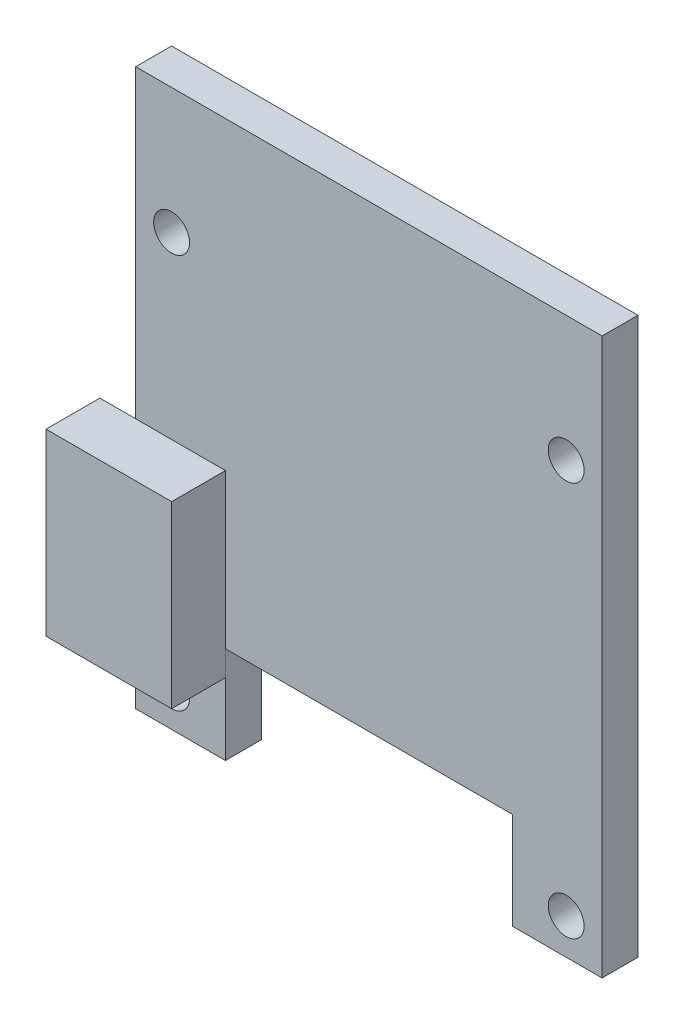
ISO-10303-21;
HEADER;
FILE_DESCRIPTION(('STEP AP214'),'2;1');
FILE_NAME('part.step','',(''),(''),'','','');
FILE_SCHEMA(('AUTOMOTIVE_DESIGN { 1 0 10303 214 1 1 1 1 }'));
ENDSEC;
DATA;
#1=APPLICATION_CONTEXT('core data for automotive mechanical design processes');
#2=APPLICATION_PROTOCOL_DEFINITION('international standard','automotive_design',2000,#1);
#3=PRODUCT_CONTEXT('',#1,'mechanical');
#4=PRODUCT('Part','Part','',(#3));
#5=PRODUCT_RELATED_PRODUCT_CATEGORY('part','',(#4));
#6=PRODUCT_DEFINITION_FORMATION('','',#4);
#7=PRODUCT_DEFINITION_CONTEXT('part definition',#1,'design');
#8=PRODUCT_DEFINITION('design','',#6,#7);
#9=PRODUCT_DEFINITION_SHAPE('','',#8);
#10=(LENGTH_UNIT() NAMED_UNIT(*) SI_UNIT(.MILLI.,.METRE.));
#11=(NAMED_UNIT(*) PLANE_ANGLE_UNIT() SI_UNIT($,.RADIAN.));
#12=(NAMED_UNIT(*) SI_UNIT($,.STERADIAN.) SOLID_ANGLE_UNIT());
#13=UNCERTAINTY_MEASURE_WITH_UNIT(LENGTH_MEASURE(1.E-05),#10,'distance_accuracy_value','');
#14=(GEOMETRIC_REPRESENTATION_CONTEXT(3) GLOBAL_UNCERTAINTY_ASSIGNED_CONTEXT((#13)) GLOBAL_UNIT_ASSIGNED_CONTEXT((#10,
#11,#12)) REPRESENTATION_CONTEXT('',''));
#15=CARTESIAN_POINT('',(0.,0.,0.));
#16=DIRECTION('',(0.,0.,1.));
#17=DIRECTION('',(1.,0.,0.));
#18=AXIS2_PLACEMENT_3D('',#15,#16,#17);
#19=CARTESIAN_POINT('',(0.,-11.5,5.));
#20=DIRECTION('',(0.,1.,0.));
#21=DIRECTION('',(0.,0.,1.));
#22=AXIS2_PLACEMENT_3D('',#19,#20,#21);
#23=PLANE('',#22);
#24=DIRECTION('',(1.,0.,0.));
#25=VECTOR('',#24,1.);
#26=CARTESIAN_POINT('',(0.,-11.5,2.));
#27=LINE('',#26,#25);
#28=CARTESIAN_POINT('',(-15.,-11.5,2.));
#29=VERTEX_POINT('',#28);
#30=CARTESIAN_POINT('',(-8.,-11.5,2.));
#31=VERTEX_POINT('',#30);
#32=EDGE_CURVE('E110',#29,#31,#27,.T.);
#33=ORIENTED_EDGE('',*,*,#32,.T.);
#34=DIRECTION('',(0.,0.,-1.));
#35=VECTOR('',#34,1.);
#36=CARTESIAN_POINT('',(-8.,-11.5,5.));
#37=LINE('',#36,#35);
#38=CARTESIAN_POINT('',(-8.,-11.5,5.));
#39=VERTEX_POINT('',#38);
#40=EDGE_CURVE('E12',#39,#31,#37,.T.);
#41=ORIENTED_EDGE('',*,*,#40,.F.);
#42=DIRECTION('',(1.,0.,0.));
#43=VECTOR('',#42,1.);
#44=CARTESIAN_POINT('',(0.,-11.5,5.));
#45=LINE('',#44,#43);
#46=CARTESIAN_POINT('',(-15.,-11.5,5.));
#47=VERTEX_POINT('',#46);
#48=EDGE_CURVE('E87',#47,#39,#45,.T.);
#49=ORIENTED_EDGE('',*,*,#48,.F.);
#50=DIRECTION('',(0.,0.,-1.));
#51=VECTOR('',#50,1.);
#52=CARTESIAN_POINT('',(-15.,-11.5,5.));
#53=LINE('',#52,#51);
#54=EDGE_CURVE('E63',#47,#29,#53,.T.);
#55=ORIENTED_EDGE('',*,*,#54,.T.);
#56=EDGE_LOOP('',(#33,#41,#49,#55));
#57=FACE_BOUND('',#56,.T.);
#58=ADVANCED_FACE('F47',(#57),#23,.F.);
#59=CARTESIAN_POINT('',(-8.,0.,5.));
#60=DIRECTION('',(1.,0.,0.));
#61=DIRECTION('',(0.,0.,-1.));
#62=AXIS2_PLACEMENT_3D('',#59,#60,#61);
#63=PLANE('',#62);
#64=DIRECTION('',(0.,-1.,0.));
#65=VECTOR('',#64,1.);
#66=CARTESIAN_POINT('',(-8.,0.,2.));
#67=LINE('',#66,#65);
#68=CARTESIAN_POINT('',(-8.,-1.5,2.));
#69=VERTEX_POINT('',#68);
#70=EDGE_CURVE('E96',#69,#31,#67,.T.);
#71=ORIENTED_EDGE('',*,*,#70,.F.);
#72=DIRECTION('',(0.,0.,-1.));
#73=VECTOR('',#72,1.);
#74=CARTESIAN_POINT('',(-8.,-1.5,5.));
#75=LINE('',#74,#73);
#76=CARTESIAN_POINT('',(-8.,-1.5,5.));
#77=VERTEX_POINT('',#76);
#78=EDGE_CURVE('E55',#77,#69,#75,.T.);
#79=ORIENTED_EDGE('',*,*,#78,.F.);
#80=DIRECTION('',(0.,-1.,0.));
#81=VECTOR('',#80,1.);
#82=CARTESIAN_POINT('',(-8.,0.,5.));
#83=LINE('',#82,#81);
#84=EDGE_CURVE('E94',#77,#39,#83,.T.);
#85=ORIENTED_EDGE('',*,*,#84,.T.);
#86=ORIENTED_EDGE('',*,*,#40,.T.);
#87=EDGE_LOOP('',(#71,#79,#85,#86));
#88=FACE_BOUND('',#87,.T.);
#89=ADVANCED_FACE('F93',(#88),#63,.T.);
#90=CARTESIAN_POINT('',(0.,-1.5,5.));
#91=DIRECTION('',(0.,1.,0.));
#92=DIRECTION('',(-1.,0.,0.));
#93=AXIS2_PLACEMENT_3D('',#90,#91,#92);
#94=PLANE('',#93);
#95=DIRECTION('',(1.,0.,0.));
#96=VECTOR('',#95,1.);
#97=CARTESIAN_POINT('',(0.,-1.5,2.));
#98=LINE('',#97,#96);
#99=CARTESIAN_POINT('',(-15.,-1.5,2.));
#100=VERTEX_POINT('',#99);
#101=EDGE_CURVE('E113',#100,#69,#98,.T.);
#102=ORIENTED_EDGE('',*,*,#101,.F.);
#103=DIRECTION('',(0.,0.,-1.));
#104=VECTOR('',#103,1.);
#105=CARTESIAN_POINT('',(-15.,-1.5,5.));
#106=LINE('',#105,#104);
#107=CARTESIAN_POINT('',(-15.,-1.5,5.));
#108=VERTEX_POINT('',#107);
#109=EDGE_CURVE('E76',#108,#100,#106,.T.);
#110=ORIENTED_EDGE('',*,*,#109,.F.);
#111=DIRECTION('',(1.,0.,0.));
#112=VECTOR('',#111,1.);
#113=CARTESIAN_POINT('',(0.,-1.5,5.));
#114=LINE('',#113,#112);
#115=EDGE_CURVE('E102',#108,#77,#114,.T.);
#116=ORIENTED_EDGE('',*,*,#115,.T.);
#117=ORIENTED_EDGE('',*,*,#78,.T.);
#118=EDGE_LOOP('',(#102,#110,#116,#117));
#119=FACE_BOUND('',#118,.T.);
#120=ADVANCED_FACE('F104',(#119),#94,.T.);
#121=CARTESIAN_POINT('',(-15.,0.,5.));
#122=DIRECTION('',(-1.,0.,0.));
#123=DIRECTION('',(0.,-1.,0.));
#124=AXIS2_PLACEMENT_3D('',#121,#122,#123);
#125=PLANE('',#124);
#126=DIRECTION('',(0.,1.,0.));
#127=VECTOR('',#126,1.);
#128=CARTESIAN_POINT('',(-15.,0.,2.));
#129=LINE('',#128,#127);
#130=EDGE_CURVE('E115',#29,#100,#129,.T.);
#131=ORIENTED_EDGE('',*,*,#130,.F.);
#132=ORIENTED_EDGE('',*,*,#54,.F.);
#133=DIRECTION('',(0.,1.,0.));
#134=VECTOR('',#133,1.);
#135=CARTESIAN_POINT('',(-15.,0.,5.));
#136=LINE('',#135,#134);
#137=EDGE_CURVE('E105',#47,#108,#136,.T.);
#138=ORIENTED_EDGE('',*,*,#137,.T.);
#139=ORIENTED_EDGE('',*,*,#109,.T.);
#140=EDGE_LOOP('',(#131,#132,#138,#139));
#141=FACE_BOUND('',#140,.T.);
#142=ADVANCED_FACE('F121',(#141),#125,.T.);
#143=CARTESIAN_POINT('',(0.,0.,5.));
#144=DIRECTION('',(0.,0.,-1.));
#145=DIRECTION('',(-1.,0.,0.));
#146=AXIS2_PLACEMENT_3D('',#143,#144,#145);
#147=PLANE('',#146);
#148=ORIENTED_EDGE('',*,*,#48,.T.);
#149=ORIENTED_EDGE('',*,*,#84,.F.);
#150=ORIENTED_EDGE('',*,*,#115,.F.);
#151=ORIENTED_EDGE('',*,*,#137,.F.);
#152=EDGE_LOOP('',(#148,#149,#150,#151));
#153=FACE_BOUND('',#152,.T.);
#154=ADVANCED_FACE('F101',(#153),#147,.F.);
#155=CARTESIAN_POINT('',(0.,0.,2.));
#156=DIRECTION('',(0.,0.,-1.));
#157=DIRECTION('',(-1.,0.,0.));
#158=AXIS2_PLACEMENT_3D('',#155,#156,#157);
#159=PLANE('',#158);
#160=ORIENTED_EDGE('',*,*,#32,.F.);
#161=ORIENTED_EDGE('',*,*,#130,.T.);
#162=ORIENTED_EDGE('',*,*,#101,.T.);
#163=ORIENTED_EDGE('',*,*,#70,.T.);
#164=EDGE_LOOP('',(#160,#161,#162,#163));
#165=FACE_BOUND('',#164,.T.);
#166=ADVANCED_FACE('F120',(#165),#159,.T.);
#167=CLOSED_SHELL('',(#58,#89,#120,#142,#154,#166));
#168=MANIFOLD_SOLID_BREP('B2',#167);
#169=CARTESIAN_POINT('',(-13.,0.,2.));
#170=DIRECTION('',(-1.,0.,0.));
#171=DIRECTION('',(0.,0.,1.));
#172=AXIS2_PLACEMENT_3D('',#169,#170,#171);
#173=PLANE('',#172);
#174=DIRECTION('',(0.,1.,0.));
#175=VECTOR('',#174,1.);
#176=CARTESIAN_POINT('',(-13.,0.,0.));
#177=LINE('',#176,#175);
#178=CARTESIAN_POINT('',(-13.,-15.5,0.));
#179=VERTEX_POINT('',#178);
#180=CARTESIAN_POINT('',(-13.,15.5,0.));
#181=VERTEX_POINT('',#180);
#182=EDGE_CURVE('E271',#179,#181,#177,.T.);
#183=ORIENTED_EDGE('',*,*,#182,.F.);
#184=DIRECTION('',(0.,0.,-1.));
#185=VECTOR('',#184,1.);
#186=CARTESIAN_POINT('',(-13.,-15.5,2.));
#187=LINE('',#186,#185);
#188=CARTESIAN_POINT('',(-13.,-15.5,2.));
#189=VERTEX_POINT('',#188);
#190=EDGE_CURVE('E45',#189,#179,#187,.T.);
#191=ORIENTED_EDGE('',*,*,#190,.F.);
#192=DIRECTION('',(0.,1.,0.));
#193=VECTOR('',#192,1.);
#194=CARTESIAN_POINT('',(-13.,0.,2.));
#195=LINE('',#194,#193);
#196=CARTESIAN_POINT('',(-13.,15.5,2.));
#197=VERTEX_POINT('',#196);
#198=EDGE_CURVE('E288',#189,#197,#195,.T.);
#199=ORIENTED_EDGE('',*,*,#198,.T.);
#200=DIRECTION('',(0.,0.,-1.));
#201=VECTOR('',#200,1.);
#202=CARTESIAN_POINT('',(-13.,15.5,2.));
#203=LINE('',#202,#201);
#204=EDGE_CURVE('E193',#197,#181,#203,.T.);
#205=ORIENTED_EDGE('',*,*,#204,.T.);
#206=EDGE_LOOP('',(#183,#191,#199,#205));
#207=FACE_BOUND('',#206,.T.);
#208=ADVANCED_FACE('F177',(#207),#173,.T.);
#209=CARTESIAN_POINT('',(0.,-15.5,2.));
#210=DIRECTION('',(0.,1.,0.));
#211=DIRECTION('',(0.,0.,1.));
#212=AXIS2_PLACEMENT_3D('',#209,#210,#211);
#213=PLANE('',#212);
#214=DIRECTION('',(1.,0.,0.));
#215=VECTOR('',#214,1.);
#216=CARTESIAN_POINT('',(0.,-15.5,0.));
#217=LINE('',#216,#215);
#218=CARTESIAN_POINT('',(-8.,-15.5,0.));
#219=VERTEX_POINT('',#218);
#220=EDGE_CURVE('E273',#179,#219,#217,.T.);
#221=ORIENTED_EDGE('',*,*,#220,.T.);
#222=DIRECTION('',(0.,0.,-1.));
#223=VECTOR('',#222,1.);
#224=CARTESIAN_POINT('',(-8.,-15.5,2.));
#225=LINE('',#224,#223);
#226=CARTESIAN_POINT('',(-8.,-15.5,2.));
#227=VERTEX_POINT('',#226);
#228=EDGE_CURVE('E185',#227,#219,#225,.T.);
#229=ORIENTED_EDGE('',*,*,#228,.F.);
#230=DIRECTION('',(1.,0.,0.));
#231=VECTOR('',#230,1.);
#232=CARTESIAN_POINT('',(0.,-15.5,2.));
#233=LINE('',#232,#231);
#234=EDGE_CURVE('E321',#189,#227,#233,.T.);
#235=ORIENTED_EDGE('',*,*,#234,.F.);
#236=ORIENTED_EDGE('',*,*,#190,.T.);
#237=EDGE_LOOP('',(#221,#229,#235,#236));
#238=FACE_BOUND('',#237,.T.);
#239=ADVANCED_FACE('F376',(#238),#213,.F.);
#240=CARTESIAN_POINT('',(-8.,0.,2.));
#241=DIRECTION('',(-1.,0.,0.));
#242=DIRECTION('',(0.,0.,1.));
#243=AXIS2_PLACEMENT_3D('',#240,#241,#242);
#244=PLANE('',#243);
#245=DIRECTION('',(0.,1.,0.));
#246=VECTOR('',#245,1.);
#247=CARTESIAN_POINT('',(-8.,0.,0.));
#248=LINE('',#247,#246);
#249=CARTESIAN_POINT('',(-8.,-10.1,0.));
#250=VERTEX_POINT('',#249);
#251=EDGE_CURVE('E276',#219,#250,#248,.T.);
#252=ORIENTED_EDGE('',*,*,#251,.T.);
#253=DIRECTION('',(0.,0.,-1.));
#254=VECTOR('',#253,1.);
#255=CARTESIAN_POINT('',(-8.,-10.1,2.));
#256=LINE('',#255,#254);
#257=CARTESIAN_POINT('',(-8.,-10.1,2.));
#258=VERTEX_POINT('',#257);
#259=EDGE_CURVE('E295',#258,#250,#256,.T.);
#260=ORIENTED_EDGE('',*,*,#259,.F.);
#261=DIRECTION('',(0.,1.,0.));
#262=VECTOR('',#261,1.);
#263=CARTESIAN_POINT('',(-8.,0.,2.));
#264=LINE('',#263,#262);
#265=EDGE_CURVE('E304',#227,#258,#264,.T.);
#266=ORIENTED_EDGE('',*,*,#265,.F.);
#267=ORIENTED_EDGE('',*,*,#228,.T.);
#268=EDGE_LOOP('',(#252,#260,#266,#267));
#269=FACE_BOUND('',#268,.T.);
#270=ADVANCED_FACE('F302',(#269),#244,.F.);
#271=CARTESIAN_POINT('',(0.,-10.1,2.));
#272=DIRECTION('',(0.,1.,0.));
#273=DIRECTION('',(0.,0.,1.));
#274=AXIS2_PLACEMENT_3D('',#271,#272,#273);
#275=PLANE('',#274);
#276=DIRECTION('',(1.,0.,0.));
#277=VECTOR('',#276,1.);
#278=CARTESIAN_POINT('',(0.,-10.1,0.));
#279=LINE('',#278,#277);
#280=CARTESIAN_POINT('',(8.,-10.1,0.));
#281=VERTEX_POINT('',#280);
#282=EDGE_CURVE('E278',#250,#281,#279,.T.);
#283=ORIENTED_EDGE('',*,*,#282,.T.);
#284=DIRECTION('',(0.,0.,-1.));
#285=VECTOR('',#284,1.);
#286=CARTESIAN_POINT('',(8.,-10.1,2.));
#287=LINE('',#286,#285);
#288=CARTESIAN_POINT('',(8.,-10.1,2.));
#289=VERTEX_POINT('',#288);
#290=EDGE_CURVE('E292',#289,#281,#287,.T.);
#291=ORIENTED_EDGE('',*,*,#290,.F.);
#292=DIRECTION('',(1.,0.,0.));
#293=VECTOR('',#292,1.);
#294=CARTESIAN_POINT('',(0.,-10.1,2.));
#295=LINE('',#294,#293);
#296=EDGE_CURVE('E317',#258,#289,#295,.T.);
#297=ORIENTED_EDGE('',*,*,#296,.F.);
#298=ORIENTED_EDGE('',*,*,#259,.T.);
#299=EDGE_LOOP('',(#283,#291,#297,#298));
#300=FACE_BOUND('',#299,.T.);
#301=ADVANCED_FACE('F313',(#300),#275,.F.);
#302=CARTESIAN_POINT('',(8.00000000000001,0.,2.));
#303=DIRECTION('',(1.,0.,0.));
#304=DIRECTION('',(0.,1.,0.));
#305=AXIS2_PLACEMENT_3D('',#302,#303,#304);
#306=PLANE('',#305);
#307=DIRECTION('',(0.,-1.,0.));
#308=VECTOR('',#307,1.);
#309=CARTESIAN_POINT('',(8.00000000000001,0.,0.));
#310=LINE('',#309,#308);
#311=CARTESIAN_POINT('',(8.,-15.5,0.));
#312=VERTEX_POINT('',#311);
#313=EDGE_CURVE('E280',#281,#312,#310,.T.);
#314=ORIENTED_EDGE('',*,*,#313,.T.);
#315=DIRECTION('',(0.,0.,-1.));
#316=VECTOR('',#315,1.);
#317=CARTESIAN_POINT('',(8.,-15.5,2.));
#318=LINE('',#317,#316);
#319=CARTESIAN_POINT('',(8.,-15.5,2.));
#320=VERTEX_POINT('',#319);
#321=EDGE_CURVE('E263',#320,#312,#318,.T.);
#322=ORIENTED_EDGE('',*,*,#321,.F.);
#323=DIRECTION('',(0.,-1.,0.));
#324=VECTOR('',#323,1.);
#325=CARTESIAN_POINT('',(8.00000000000001,0.,2.));
#326=LINE('',#325,#324);
#327=EDGE_CURVE('E251',#289,#320,#326,.T.);
#328=ORIENTED_EDGE('',*,*,#327,.F.);
#329=ORIENTED_EDGE('',*,*,#290,.T.);
#330=EDGE_LOOP('',(#314,#322,#328,#329));
#331=FACE_BOUND('',#330,.T.);
#332=ADVANCED_FACE('F316',(#331),#306,.F.);
#333=CARTESIAN_POINT('',(0.,-15.5,2.));
#334=DIRECTION('',(0.,1.,0.));
#335=DIRECTION('',(0.,0.,1.));
#336=AXIS2_PLACEMENT_3D('',#333,#334,#335);
#337=PLANE('',#336);
#338=DIRECTION('',(1.,0.,0.));
#339=VECTOR('',#338,1.);
#340=CARTESIAN_POINT('',(0.,-15.5,0.));
#341=LINE('',#340,#339);
#342=CARTESIAN_POINT('',(13.,-15.5,0.));
#343=VERTEX_POINT('',#342);
#344=EDGE_CURVE('E260',#312,#343,#341,.T.);
#345=ORIENTED_EDGE('',*,*,#344,.T.);
#346=DIRECTION('',(0.,0.,-1.));
#347=VECTOR('',#346,1.);
#348=CARTESIAN_POINT('',(13.,-15.5,2.));
#349=LINE('',#348,#347);
#350=CARTESIAN_POINT('',(13.,-15.5,2.));
#351=VERTEX_POINT('',#350);
#352=EDGE_CURVE('E257',#351,#343,#349,.T.);
#353=ORIENTED_EDGE('',*,*,#352,.F.);
#354=DIRECTION('',(1.,0.,0.));
#355=VECTOR('',#354,1.);
#356=CARTESIAN_POINT('',(0.,-15.5,2.));
#357=LINE('',#356,#355);
#358=EDGE_CURVE('E243',#320,#351,#357,.T.);
#359=ORIENTED_EDGE('',*,*,#358,.F.);
#360=ORIENTED_EDGE('',*,*,#321,.T.);
#361=EDGE_LOOP('',(#345,#353,#359,#360));
#362=FACE_BOUND('',#361,.T.);
#363=ADVANCED_FACE('F258',(#362),#337,.F.);
#364=CARTESIAN_POINT('',(13.,0.,2.));
#365=DIRECTION('',(-1.,0.,0.));
#366=DIRECTION('',(0.,0.,1.));
#367=AXIS2_PLACEMENT_3D('',#364,#365,#366);
#368=PLANE('',#367);
#369=DIRECTION('',(0.,1.,0.));
#370=VECTOR('',#369,1.);
#371=CARTESIAN_POINT('',(13.,0.,0.));
#372=LINE('',#371,#370);
#373=CARTESIAN_POINT('',(13.,15.5,0.));
#374=VERTEX_POINT('',#373);
#375=EDGE_CURVE('E283',#343,#374,#372,.T.);
#376=ORIENTED_EDGE('',*,*,#375,.T.);
#377=DIRECTION('',(0.,0.,-1.));
#378=VECTOR('',#377,1.);
#379=CARTESIAN_POINT('',(13.,15.5,2.));
#380=LINE('',#379,#378);
#381=CARTESIAN_POINT('',(13.,15.5,2.));
#382=VERTEX_POINT('',#381);
#383=EDGE_CURVE('E219',#382,#374,#380,.T.);
#384=ORIENTED_EDGE('',*,*,#383,.F.);
#385=DIRECTION('',(0.,1.,0.));
#386=VECTOR('',#385,1.);
#387=CARTESIAN_POINT('',(13.,0.,2.));
#388=LINE('',#387,#386);
#389=EDGE_CURVE('E249',#351,#382,#388,.T.);
#390=ORIENTED_EDGE('',*,*,#389,.F.);
#391=ORIENTED_EDGE('',*,*,#352,.T.);
#392=EDGE_LOOP('',(#376,#384,#390,#391));
#393=FACE_BOUND('',#392,.T.);
#394=ADVANCED_FACE('F265',(#393),#368,.F.);
#395=CARTESIAN_POINT('',(0.,15.5,2.));
#396=DIRECTION('',(0.,1.,0.));
#397=DIRECTION('',(0.,0.,1.));
#398=AXIS2_PLACEMENT_3D('',#395,#396,#397);
#399=PLANE('',#398);
#400=DIRECTION('',(1.,0.,0.));
#401=VECTOR('',#400,1.);
#402=CARTESIAN_POINT('',(0.,15.5,0.));
#403=LINE('',#402,#401);
#404=EDGE_CURVE('E285',#181,#374,#403,.T.);
#405=ORIENTED_EDGE('',*,*,#404,.F.);
#406=ORIENTED_EDGE('',*,*,#204,.F.);
#407=DIRECTION('',(1.,0.,0.));
#408=VECTOR('',#407,1.);
#409=CARTESIAN_POINT('',(0.,15.5,2.));
#410=LINE('',#409,#408);
#411=EDGE_CURVE('E266',#197,#382,#410,.T.);
#412=ORIENTED_EDGE('',*,*,#411,.T.);
#413=ORIENTED_EDGE('',*,*,#383,.T.);
#414=EDGE_LOOP('',(#405,#406,#412,#413));
#415=FACE_BOUND('',#414,.T.);
#416=ADVANCED_FACE('F360',(#415),#399,.T.);
#417=CARTESIAN_POINT('',(0.,0.,2.));
#418=DIRECTION('',(0.,0.,1.));
#419=DIRECTION('',(1.,0.,0.));
#420=AXIS2_PLACEMENT_3D('',#417,#418,#419);
#421=PLANE('',#420);
#422=CARTESIAN_POINT('',(-11.,-13.5,2.));
#423=DIRECTION('',(0.,0.,1.));
#424=DIRECTION('',(-1.,0.,0.));
#425=AXIS2_PLACEMENT_3D('',#422,#423,#424);
#426=CIRCLE('',#425,1.);
#427=CARTESIAN_POINT('',(-12.,-13.5,2.));
#428=VERTEX_POINT('',#427);
#429=EDGE_CURVE('E337',#428,#428,#426,.T.);
#430=ORIENTED_EDGE('',*,*,#429,.F.);
#431=EDGE_LOOP('',(#430));
#432=FACE_BOUND('',#431,.T.);
#433=CARTESIAN_POINT('',(11.,8.5,2.));
#434=DIRECTION('',(0.,0.,1.));
#435=DIRECTION('',(1.,0.,0.));
#436=AXIS2_PLACEMENT_3D('',#433,#434,#435);
#437=CIRCLE('',#436,0.999999999999999);
#438=CARTESIAN_POINT('',(12.,8.5,2.));
#439=VERTEX_POINT('',#438);
#440=EDGE_CURVE('E330',#439,#439,#437,.T.);
#441=ORIENTED_EDGE('',*,*,#440,.F.);
#442=EDGE_LOOP('',(#441));
#443=FACE_BOUND('',#442,.T.);
#444=CARTESIAN_POINT('',(-11.,8.5,2.));
#445=DIRECTION('',(0.,0.,1.));
#446=DIRECTION('',(-1.,0.,0.));
#447=AXIS2_PLACEMENT_3D('',#444,#445,#446);
#448=CIRCLE('',#447,0.999999999999999);
#449=CARTESIAN_POINT('',(-12.,8.5,2.));
#450=VERTEX_POINT('',#449);
#451=EDGE_CURVE('E342',#450,#450,#448,.T.);
#452=ORIENTED_EDGE('',*,*,#451,.F.);
#453=EDGE_LOOP('',(#452));
#454=FACE_BOUND('',#453,.T.);
#455=CARTESIAN_POINT('',(11.,-13.5,2.));
#456=DIRECTION('',(0.,0.,1.));
#457=DIRECTION('',(1.,0.,0.));
#458=AXIS2_PLACEMENT_3D('',#455,#456,#457);
#459=CIRCLE('',#458,1.);
#460=CARTESIAN_POINT('',(12.,-13.5,2.));
#461=VERTEX_POINT('',#460);
#462=EDGE_CURVE('E324',#461,#461,#459,.T.);
#463=ORIENTED_EDGE('',*,*,#462,.F.);
#464=EDGE_LOOP('',(#463));
#465=FACE_BOUND('',#464,.T.);
#466=ORIENTED_EDGE('',*,*,#198,.F.);
#467=ORIENTED_EDGE('',*,*,#234,.T.);
#468=ORIENTED_EDGE('',*,*,#265,.T.);
#469=ORIENTED_EDGE('',*,*,#296,.T.);
#470=ORIENTED_EDGE('',*,*,#327,.T.);
#471=ORIENTED_EDGE('',*,*,#358,.T.);
#472=ORIENTED_EDGE('',*,*,#389,.T.);
#473=ORIENTED_EDGE('',*,*,#411,.F.);
#474=EDGE_LOOP('',(#466,#467,#468,#469,#470,#471,#472,#473));
#475=FACE_BOUND('',#474,.T.);
#476=ADVANCED_FACE('F246',(#432,#443,#454,#465,#475),#421,.T.);
#477=CARTESIAN_POINT('',(0.,0.,0.));
#478=DIRECTION('',(0.,0.,1.));
#479=DIRECTION('',(1.,0.,0.));
#480=AXIS2_PLACEMENT_3D('',#477,#478,#479);
#481=PLANE('',#480);
#482=CARTESIAN_POINT('',(-11.,-13.5,0.));
#483=DIRECTION('',(0.,0.,1.));
#484=DIRECTION('',(-1.,0.,0.));
#485=AXIS2_PLACEMENT_3D('',#482,#483,#484);
#486=CIRCLE('',#485,1.);
#487=CARTESIAN_POINT('',(-12.,-13.5,0.));
#488=VERTEX_POINT('',#487);
#489=EDGE_CURVE('E327',#488,#488,#486,.T.);
#490=ORIENTED_EDGE('',*,*,#489,.T.);
#491=EDGE_LOOP('',(#490));
#492=FACE_BOUND('',#491,.T.);
#493=CARTESIAN_POINT('',(11.,8.5,0.));
#494=DIRECTION('',(0.,0.,1.));
#495=DIRECTION('',(1.,0.,0.));
#496=AXIS2_PLACEMENT_3D('',#493,#494,#495);
#497=CIRCLE('',#496,0.999999999999999);
#498=CARTESIAN_POINT('',(12.,8.5,0.));
#499=VERTEX_POINT('',#498);
#500=EDGE_CURVE('E333',#499,#499,#497,.T.);
#501=ORIENTED_EDGE('',*,*,#500,.T.);
#502=EDGE_LOOP('',(#501));
#503=FACE_BOUND('',#502,.T.);
#504=CARTESIAN_POINT('',(-11.,8.5,0.));
#505=DIRECTION('',(0.,0.,1.));
#506=DIRECTION('',(-1.,0.,0.));
#507=AXIS2_PLACEMENT_3D('',#504,#505,#506);
#508=CIRCLE('',#507,0.999999999999999);
#509=CARTESIAN_POINT('',(-12.,8.5,0.));
#510=VERTEX_POINT('',#509);
#511=EDGE_CURVE('E334',#510,#510,#508,.T.);
#512=ORIENTED_EDGE('',*,*,#511,.T.);
#513=EDGE_LOOP('',(#512));
#514=FACE_BOUND('',#513,.T.);
#515=CARTESIAN_POINT('',(11.,-13.5,0.));
#516=DIRECTION('',(0.,0.,1.));
#517=DIRECTION('',(1.,0.,0.));
#518=AXIS2_PLACEMENT_3D('',#515,#516,#517);
#519=CIRCLE('',#518,1.);
#520=CARTESIAN_POINT('',(12.,-13.5,0.));
#521=VERTEX_POINT('',#520);
#522=EDGE_CURVE('E274',#521,#521,#519,.T.);
#523=ORIENTED_EDGE('',*,*,#522,.T.);
#524=EDGE_LOOP('',(#523));
#525=FACE_BOUND('',#524,.T.);
#526=ORIENTED_EDGE('',*,*,#182,.T.);
#527=ORIENTED_EDGE('',*,*,#404,.T.);
#528=ORIENTED_EDGE('',*,*,#375,.F.);
#529=ORIENTED_EDGE('',*,*,#344,.F.);
#530=ORIENTED_EDGE('',*,*,#313,.F.);
#531=ORIENTED_EDGE('',*,*,#282,.F.);
#532=ORIENTED_EDGE('',*,*,#251,.F.);
#533=ORIENTED_EDGE('',*,*,#220,.F.);
#534=EDGE_LOOP('',(#526,#527,#528,#529,#530,#531,#532,#533));
#535=FACE_BOUND('',#534,.T.);
#536=ADVANCED_FACE('F309',(#492,#503,#514,#525,#535),#481,.F.);
#537=CARTESIAN_POINT('',(11.,-13.5,0.));
#538=DIRECTION('',(0.,0.,1.));
#539=DIRECTION('',(1.,0.,0.));
#540=AXIS2_PLACEMENT_3D('',#537,#538,#539);
#541=CYLINDRICAL_SURFACE('',#540,1.);
#542=ORIENTED_EDGE('',*,*,#522,.F.);
#543=EDGE_LOOP('',(#542));
#544=FACE_BOUND('',#543,.T.);
#545=ORIENTED_EDGE('',*,*,#462,.T.);
#546=EDGE_LOOP('',(#545));
#547=FACE_BOUND('',#546,.T.);
#548=ADVANCED_FACE('F354',(#544,#547),#541,.F.);
#549=CARTESIAN_POINT('',(-11.,8.5,0.));
#550=DIRECTION('',(0.,0.,1.));
#551=DIRECTION('',(1.,0.,0.));
#552=AXIS2_PLACEMENT_3D('',#549,#550,#551);
#553=CYLINDRICAL_SURFACE('',#552,0.999999999999999);
#554=ORIENTED_EDGE('',*,*,#511,.F.);
#555=EDGE_LOOP('',(#554));
#556=FACE_BOUND('',#555,.T.);
#557=ORIENTED_EDGE('',*,*,#451,.T.);
#558=EDGE_LOOP('',(#557));
#559=FACE_BOUND('',#558,.T.);
#560=ADVANCED_FACE('F350',(#556,#559),#553,.F.);
#561=CARTESIAN_POINT('',(11.,8.5,0.));
#562=DIRECTION('',(0.,0.,1.));
#563=DIRECTION('',(1.,0.,0.));
#564=AXIS2_PLACEMENT_3D('',#561,#562,#563);
#565=CYLINDRICAL_SURFACE('',#564,0.999999999999999);
#566=ORIENTED_EDGE('',*,*,#500,.F.);
#567=EDGE_LOOP('',(#566));
#568=FACE_BOUND('',#567,.T.);
#569=ORIENTED_EDGE('',*,*,#440,.T.);
#570=EDGE_LOOP('',(#569));
#571=FACE_BOUND('',#570,.T.);
#572=ADVANCED_FACE('F353',(#568,#571),#565,.F.);
#573=CARTESIAN_POINT('',(-11.,-13.5,0.));
#574=DIRECTION('',(0.,0.,1.));
#575=DIRECTION('',(1.,0.,0.));
#576=AXIS2_PLACEMENT_3D('',#573,#574,#575);
#577=CYLINDRICAL_SURFACE('',#576,1.);
#578=ORIENTED_EDGE('',*,*,#489,.F.);
#579=EDGE_LOOP('',(#578));
#580=FACE_BOUND('',#579,.T.);
#581=ORIENTED_EDGE('',*,*,#429,.T.);
#582=EDGE_LOOP('',(#581));
#583=FACE_BOUND('',#582,.T.);
#584=ADVANCED_FACE('F453',(#580,#583),#577,.F.);
#585=CLOSED_SHELL('',(#208,#239,#270,#301,#332,#363,#394,#416,#476,#536,#548,#560,#572,#584));
#586=MANIFOLD_SOLID_BREP('B6',#585);
#587=ADVANCED_BREP_SHAPE_REPRESENTATION('',(#18,#168,#586),#14);
#588=SHAPE_DEFINITION_REPRESENTATION(#9,#587);
ENDSEC;
END-ISO-10303-21;
